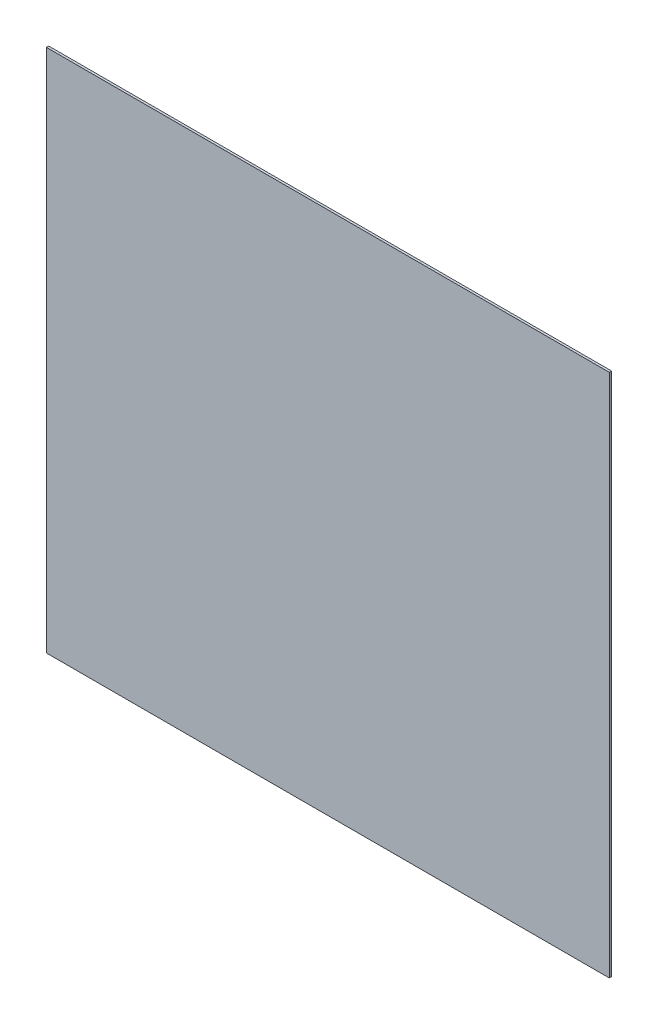
ISO-10303-21;
HEADER;
FILE_DESCRIPTION(('STEP AP214'),'2;1');
FILE_NAME('part.step','',(''),(''),'','','');
FILE_SCHEMA(('AUTOMOTIVE_DESIGN { 1 0 10303 214 1 1 1 1 }'));
ENDSEC;
DATA;
#1=APPLICATION_CONTEXT('core data for automotive mechanical design processes');
#2=APPLICATION_PROTOCOL_DEFINITION('international standard','automotive_design',2000,#1);
#3=PRODUCT_CONTEXT('',#1,'mechanical');
#4=PRODUCT('Part','Part','',(#3));
#5=PRODUCT_RELATED_PRODUCT_CATEGORY('part','',(#4));
#6=PRODUCT_DEFINITION_FORMATION('','',#4);
#7=PRODUCT_DEFINITION_CONTEXT('part definition',#1,'design');
#8=PRODUCT_DEFINITION('design','',#6,#7);
#9=PRODUCT_DEFINITION_SHAPE('','',#8);
#10=(LENGTH_UNIT() NAMED_UNIT(*) SI_UNIT(.MILLI.,.METRE.));
#11=(NAMED_UNIT(*) PLANE_ANGLE_UNIT() SI_UNIT($,.RADIAN.));
#12=(NAMED_UNIT(*) SI_UNIT($,.STERADIAN.) SOLID_ANGLE_UNIT());
#13=UNCERTAINTY_MEASURE_WITH_UNIT(LENGTH_MEASURE(1.E-05),#10,'distance_accuracy_value','');
#14=(GEOMETRIC_REPRESENTATION_CONTEXT(3) GLOBAL_UNCERTAINTY_ASSIGNED_CONTEXT((#13)) GLOBAL_UNIT_ASSIGNED_CONTEXT((#10,
#11,#12)) REPRESENTATION_CONTEXT('',''));
#15=CARTESIAN_POINT('',(0.,0.,0.));
#16=DIRECTION('',(0.,0.,1.));
#17=DIRECTION('',(1.,0.,0.));
#18=AXIS2_PLACEMENT_3D('',#15,#16,#17);
#19=CARTESIAN_POINT('',(389.,-362.5,3.175));
#20=DIRECTION('',(-1.,0.,0.));
#21=DIRECTION('',(0.,0.,1.));
#22=AXIS2_PLACEMENT_3D('',#19,#20,#21);
#23=PLANE('',#22);
#24=DIRECTION('',(0.,1.,0.));
#25=VECTOR('',#24,1.);
#26=CARTESIAN_POINT('',(389.,-362.5,0.));
#27=LINE('',#26,#25);
#28=CARTESIAN_POINT('',(389.,-362.5,0.));
#29=VERTEX_POINT('',#28);
#30=CARTESIAN_POINT('',(389.,362.5,0.));
#31=VERTEX_POINT('',#30);
#32=EDGE_CURVE('E113',#29,#31,#27,.T.);
#33=ORIENTED_EDGE('',*,*,#32,.T.);
#34=DIRECTION('',(0.,0.,-1.));
#35=VECTOR('',#34,1.);
#36=CARTESIAN_POINT('',(389.,362.5,3.175));
#37=LINE('',#36,#35);
#38=CARTESIAN_POINT('',(389.,362.5,3.175));
#39=VERTEX_POINT('',#38);
#40=EDGE_CURVE('E11',#39,#31,#37,.T.);
#41=ORIENTED_EDGE('',*,*,#40,.F.);
#42=DIRECTION('',(0.,1.,0.));
#43=VECTOR('',#42,1.);
#44=CARTESIAN_POINT('',(389.,-362.5,3.175));
#45=LINE('',#44,#43);
#46=CARTESIAN_POINT('',(389.,-362.5,3.175));
#47=VERTEX_POINT('',#46);
#48=EDGE_CURVE('E97',#47,#39,#45,.T.);
#49=ORIENTED_EDGE('',*,*,#48,.F.);
#50=DIRECTION('',(0.,0.,-1.));
#51=VECTOR('',#50,1.);
#52=CARTESIAN_POINT('',(389.,-362.5,3.175));
#53=LINE('',#52,#51);
#54=EDGE_CURVE('E109',#47,#29,#53,.T.);
#55=ORIENTED_EDGE('',*,*,#54,.T.);
#56=EDGE_LOOP('',(#33,#41,#49,#55));
#57=FACE_BOUND('',#56,.T.);
#58=ADVANCED_FACE('F45',(#57),#23,.F.);
#59=CARTESIAN_POINT('',(-389.,362.5,3.175));
#60=DIRECTION('',(0.,-1.,0.));
#61=DIRECTION('',(0.,0.,-1.));
#62=AXIS2_PLACEMENT_3D('',#59,#60,#61);
#63=PLANE('',#62);
#64=DIRECTION('',(-1.,0.,0.));
#65=VECTOR('',#64,1.);
#66=CARTESIAN_POINT('',(-389.,362.5,0.));
#67=LINE('',#66,#65);
#68=CARTESIAN_POINT('',(-389.,362.5,0.));
#69=VERTEX_POINT('',#68);
#70=EDGE_CURVE('E102',#31,#69,#67,.T.);
#71=ORIENTED_EDGE('',*,*,#70,.T.);
#72=DIRECTION('',(0.,0.,-1.));
#73=VECTOR('',#72,1.);
#74=CARTESIAN_POINT('',(-389.,362.5,3.175));
#75=LINE('',#74,#73);
#76=CARTESIAN_POINT('',(-389.,362.5,3.175));
#77=VERTEX_POINT('',#76);
#78=EDGE_CURVE('E54',#77,#69,#75,.T.);
#79=ORIENTED_EDGE('',*,*,#78,.F.);
#80=DIRECTION('',(-1.,0.,0.));
#81=VECTOR('',#80,1.);
#82=CARTESIAN_POINT('',(-389.,362.5,3.175));
#83=LINE('',#82,#81);
#84=EDGE_CURVE('E92',#39,#77,#83,.T.);
#85=ORIENTED_EDGE('',*,*,#84,.F.);
#86=ORIENTED_EDGE('',*,*,#40,.T.);
#87=EDGE_LOOP('',(#71,#79,#85,#86));
#88=FACE_BOUND('',#87,.T.);
#89=ADVANCED_FACE('F101',(#88),#63,.F.);
#90=CARTESIAN_POINT('',(-389.,-362.5,3.175));
#91=DIRECTION('',(1.,0.,0.));
#92=DIRECTION('',(0.,0.,-1.));
#93=AXIS2_PLACEMENT_3D('',#90,#91,#92);
#94=PLANE('',#93);
#95=DIRECTION('',(0.,-1.,0.));
#96=VECTOR('',#95,1.);
#97=CARTESIAN_POINT('',(-389.,-362.5,0.));
#98=LINE('',#97,#96);
#99=CARTESIAN_POINT('',(-389.,-362.5,0.));
#100=VERTEX_POINT('',#99);
#101=EDGE_CURVE('E79',#69,#100,#98,.T.);
#102=ORIENTED_EDGE('',*,*,#101,.T.);
#103=DIRECTION('',(0.,0.,-1.));
#104=VECTOR('',#103,1.);
#105=CARTESIAN_POINT('',(-389.,-362.5,3.175));
#106=LINE('',#105,#104);
#107=CARTESIAN_POINT('',(-389.,-362.5,3.175));
#108=VERTEX_POINT('',#107);
#109=EDGE_CURVE('E104',#108,#100,#106,.T.);
#110=ORIENTED_EDGE('',*,*,#109,.F.);
#111=DIRECTION('',(0.,-1.,0.));
#112=VECTOR('',#111,1.);
#113=CARTESIAN_POINT('',(-389.,-362.5,3.175));
#114=LINE('',#113,#112);
#115=EDGE_CURVE('E95',#77,#108,#114,.T.);
#116=ORIENTED_EDGE('',*,*,#115,.F.);
#117=ORIENTED_EDGE('',*,*,#78,.T.);
#118=EDGE_LOOP('',(#102,#110,#116,#117));
#119=FACE_BOUND('',#118,.T.);
#120=ADVANCED_FACE('F105',(#119),#94,.F.);
#121=CARTESIAN_POINT('',(-389.,-362.5,3.175));
#122=DIRECTION('',(0.,1.,0.));
#123=DIRECTION('',(0.,0.,1.));
#124=AXIS2_PLACEMENT_3D('',#121,#122,#123);
#125=PLANE('',#124);
#126=DIRECTION('',(1.,0.,0.));
#127=VECTOR('',#126,1.);
#128=CARTESIAN_POINT('',(-389.,-362.5,0.));
#129=LINE('',#128,#127);
#130=EDGE_CURVE('E85',#100,#29,#129,.T.);
#131=ORIENTED_EDGE('',*,*,#130,.T.);
#132=ORIENTED_EDGE('',*,*,#54,.F.);
#133=DIRECTION('',(1.,0.,0.));
#134=VECTOR('',#133,1.);
#135=CARTESIAN_POINT('',(-389.,-362.5,3.175));
#136=LINE('',#135,#134);
#137=EDGE_CURVE('E62',#108,#47,#136,.T.);
#138=ORIENTED_EDGE('',*,*,#137,.F.);
#139=ORIENTED_EDGE('',*,*,#109,.T.);
#140=EDGE_LOOP('',(#131,#132,#138,#139));
#141=FACE_BOUND('',#140,.T.);
#142=ADVANCED_FACE('F126',(#141),#125,.F.);
#143=CARTESIAN_POINT('',(0.,0.,3.175));
#144=DIRECTION('',(0.,0.,-1.));
#145=DIRECTION('',(-1.,0.,0.));
#146=AXIS2_PLACEMENT_3D('',#143,#144,#145);
#147=PLANE('',#146);
#148=ORIENTED_EDGE('',*,*,#48,.T.);
#149=ORIENTED_EDGE('',*,*,#84,.T.);
#150=ORIENTED_EDGE('',*,*,#115,.T.);
#151=ORIENTED_EDGE('',*,*,#137,.T.);
#152=EDGE_LOOP('',(#148,#149,#150,#151));
#153=FACE_BOUND('',#152,.T.);
#154=ADVANCED_FACE('F93',(#153),#147,.F.);
#155=CARTESIAN_POINT('',(0.,0.,0.));
#156=DIRECTION('',(0.,0.,-1.));
#157=DIRECTION('',(-1.,0.,0.));
#158=AXIS2_PLACEMENT_3D('',#155,#156,#157);
#159=PLANE('',#158);
#160=ORIENTED_EDGE('',*,*,#32,.F.);
#161=ORIENTED_EDGE('',*,*,#130,.F.);
#162=ORIENTED_EDGE('',*,*,#101,.F.);
#163=ORIENTED_EDGE('',*,*,#70,.F.);
#164=EDGE_LOOP('',(#160,#161,#162,#163));
#165=FACE_BOUND('',#164,.T.);
#166=ADVANCED_FACE('F129',(#165),#159,.T.);
#167=CLOSED_SHELL('',(#58,#89,#120,#142,#154,#166));
#168=MANIFOLD_SOLID_BREP('B2',#167);
#169=ADVANCED_BREP_SHAPE_REPRESENTATION('',(#18,#168),#14);
#170=SHAPE_DEFINITION_REPRESENTATION(#9,#169);
ENDSEC;
END-ISO-10303-21;
